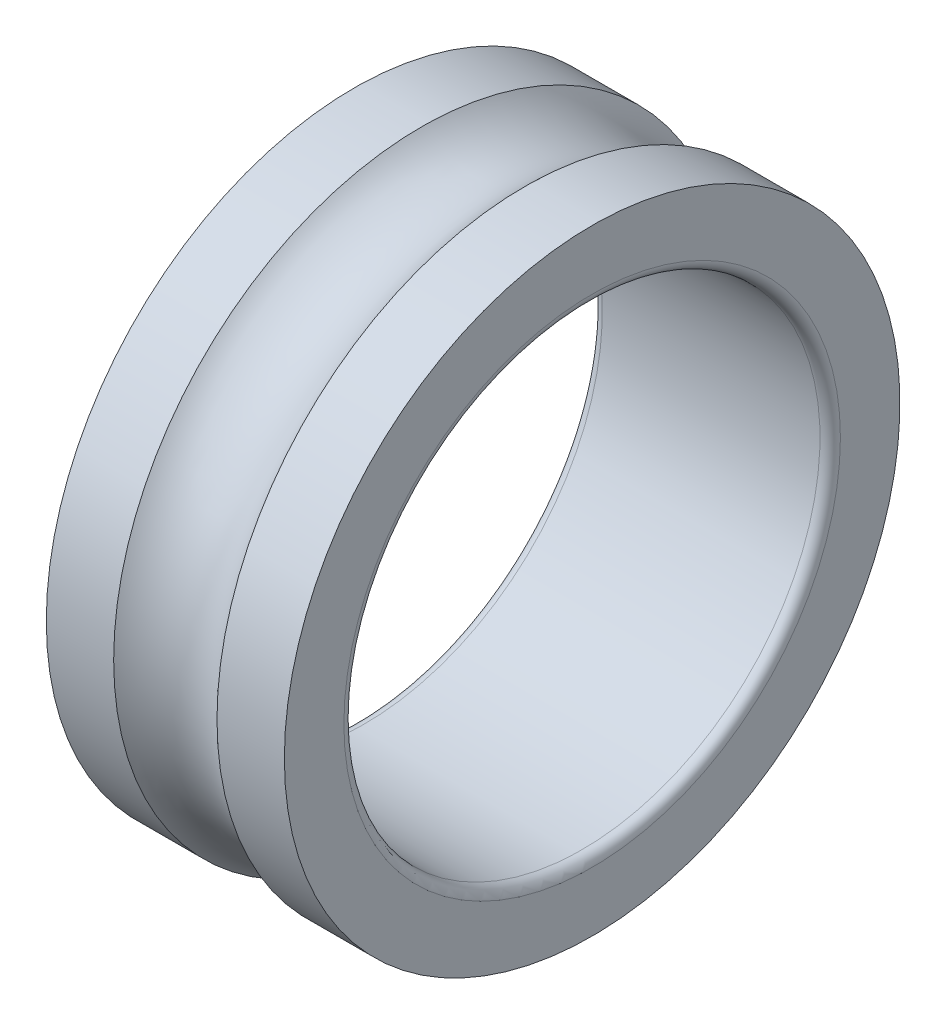
ISO-10303-21;
HEADER;
FILE_DESCRIPTION(('STEP AP214'),'2;1');
FILE_NAME('part.step','',(''),(''),'','','');
FILE_SCHEMA(('AUTOMOTIVE_DESIGN { 1 0 10303 214 1 1 1 1 }'));
ENDSEC;
DATA;
#1=APPLICATION_CONTEXT('core data for automotive mechanical design processes');
#2=APPLICATION_PROTOCOL_DEFINITION('international standard','automotive_design',2000,#1);
#3=PRODUCT_CONTEXT('',#1,'mechanical');
#4=PRODUCT('Part','Part','',(#3));
#5=PRODUCT_RELATED_PRODUCT_CATEGORY('part','',(#4));
#6=PRODUCT_DEFINITION_FORMATION('','',#4);
#7=PRODUCT_DEFINITION_CONTEXT('part definition',#1,'design');
#8=PRODUCT_DEFINITION('design','',#6,#7);
#9=PRODUCT_DEFINITION_SHAPE('','',#8);
#10=(LENGTH_UNIT() NAMED_UNIT(*) SI_UNIT(.MILLI.,.METRE.));
#11=(NAMED_UNIT(*) PLANE_ANGLE_UNIT() SI_UNIT($,.RADIAN.));
#12=(NAMED_UNIT(*) SI_UNIT($,.STERADIAN.) SOLID_ANGLE_UNIT());
#13=UNCERTAINTY_MEASURE_WITH_UNIT(LENGTH_MEASURE(1.E-05),#10,'distance_accuracy_value','');
#14=(GEOMETRIC_REPRESENTATION_CONTEXT(3) GLOBAL_UNCERTAINTY_ASSIGNED_CONTEXT((#13)) GLOBAL_UNIT_ASSIGNED_CONTEXT((#10,
#11,#12)) REPRESENTATION_CONTEXT('',''));
#15=CARTESIAN_POINT('',(0.,0.,0.));
#16=DIRECTION('',(0.,0.,1.));
#17=DIRECTION('',(1.,0.,0.));
#18=AXIS2_PLACEMENT_3D('',#15,#16,#17);
#19=CARTESIAN_POINT('',(3.5,0.,0.));
#20=DIRECTION('',(-1.,0.,0.));
#21=DIRECTION('',(0.,0.,1.));
#22=AXIS2_PLACEMENT_3D('',#19,#20,#21);
#23=CYLINDRICAL_SURFACE('',#22,4.525);
#24=CARTESIAN_POINT('',(0.,0.,0.));
#25=DIRECTION('',(-1.,0.,0.));
#26=DIRECTION('',(0.,0.,1.));
#27=AXIS2_PLACEMENT_3D('',#24,#25,#26);
#28=CIRCLE('',#27,4.525);
#29=CARTESIAN_POINT('',(0.,0.,4.525));
#30=VERTEX_POINT('',#29);
#31=EDGE_CURVE('E10',#30,#30,#28,.T.);
#32=ORIENTED_EDGE('',*,*,#31,.F.);
#33=EDGE_LOOP('',(#32));
#34=FACE_BOUND('',#33,.T.);
#35=CARTESIAN_POINT('',(0.99047712345183,0.,0.));
#36=DIRECTION('',(-1.,0.,0.));
#37=DIRECTION('',(0.,0.,1.));
#38=AXIS2_PLACEMENT_3D('',#35,#36,#37);
#39=CIRCLE('',#38,4.525);
#40=CARTESIAN_POINT('',(0.99047712345183,0.,4.525));
#41=VERTEX_POINT('',#40);
#42=EDGE_CURVE('E57',#41,#41,#39,.T.);
#43=ORIENTED_EDGE('',*,*,#42,.T.);
#44=EDGE_LOOP('',(#43));
#45=FACE_BOUND('',#44,.T.);
#46=ADVANCED_FACE('F29',(#34,#45),#23,.T.);
#47=CARTESIAN_POINT('',(0.,4.525,0.));
#48=DIRECTION('',(1.,0.,0.));
#49=DIRECTION('',(0.,0.,-1.));
#50=AXIS2_PLACEMENT_3D('',#47,#48,#49);
#51=PLANE('',#50);
#52=CARTESIAN_POINT('',(0.,0.,0.));
#53=DIRECTION('',(-1.,0.,0.));
#54=DIRECTION('',(0.,0.,1.));
#55=AXIS2_PLACEMENT_3D('',#52,#53,#54);
#56=CIRCLE('',#55,3.65);
#57=CARTESIAN_POINT('',(0.,0.,3.65));
#58=VERTEX_POINT('',#57);
#59=EDGE_CURVE('E35',#58,#58,#56,.T.);
#60=ORIENTED_EDGE('',*,*,#59,.F.);
#61=EDGE_LOOP('',(#60));
#62=FACE_BOUND('',#61,.T.);
#63=ORIENTED_EDGE('',*,*,#31,.T.);
#64=EDGE_LOOP('',(#63));
#65=FACE_BOUND('',#64,.T.);
#66=ADVANCED_FACE('F94',(#62,#65),#51,.F.);
#67=CARTESIAN_POINT('',(0.14999999999997,0.,0.));
#68=DIRECTION('',(-1.,0.,0.));
#69=DIRECTION('',(0.,0.,1.));
#70=AXIS2_PLACEMENT_3D('',#67,#68,#69);
#71=TOROIDAL_SURFACE('',#70,3.64999999999997,0.14999999999997);
#72=CARTESIAN_POINT('',(0.15,0.,0.));
#73=DIRECTION('',(-1.,0.,0.));
#74=DIRECTION('',(0.,0.,1.));
#75=AXIS2_PLACEMENT_3D('',#72,#73,#74);
#76=CIRCLE('',#75,3.5);
#77=CARTESIAN_POINT('',(0.15,0.,3.5));
#78=VERTEX_POINT('',#77);
#79=EDGE_CURVE('E39',#78,#78,#76,.T.);
#80=ORIENTED_EDGE('',*,*,#79,.F.);
#81=EDGE_LOOP('',(#80));
#82=FACE_BOUND('',#81,.T.);
#83=ORIENTED_EDGE('',*,*,#59,.T.);
#84=EDGE_LOOP('',(#83));
#85=FACE_BOUND('',#84,.T.);
#86=ADVANCED_FACE('F89',(#82,#85),#71,.T.);
#87=CARTESIAN_POINT('',(3.5,0.,0.));
#88=DIRECTION('',(-1.,0.,0.));
#89=DIRECTION('',(0.,0.,1.));
#90=AXIS2_PLACEMENT_3D('',#87,#88,#89);
#91=CYLINDRICAL_SURFACE('',#90,3.5);
#92=CARTESIAN_POINT('',(3.35,0.,0.));
#93=DIRECTION('',(-1.,0.,0.));
#94=DIRECTION('',(0.,0.,1.));
#95=AXIS2_PLACEMENT_3D('',#92,#93,#94);
#96=CIRCLE('',#95,3.5);
#97=CARTESIAN_POINT('',(3.35,0.,3.5));
#98=VERTEX_POINT('',#97);
#99=EDGE_CURVE('E43',#98,#98,#96,.T.);
#100=ORIENTED_EDGE('',*,*,#99,.F.);
#101=EDGE_LOOP('',(#100));
#102=FACE_BOUND('',#101,.T.);
#103=ORIENTED_EDGE('',*,*,#79,.T.);
#104=EDGE_LOOP('',(#103));
#105=FACE_BOUND('',#104,.T.);
#106=ADVANCED_FACE('F83',(#102,#105),#91,.F.);
#107=CARTESIAN_POINT('',(3.35000000000006,0.,0.));
#108=DIRECTION('',(-1.,0.,0.));
#109=DIRECTION('',(0.,0.,1.));
#110=AXIS2_PLACEMENT_3D('',#107,#108,#109);
#111=TOROIDAL_SURFACE('',#110,3.64999999999994,0.149999999999939);
#112=CARTESIAN_POINT('',(3.5,0.,0.));
#113=DIRECTION('',(-1.,0.,0.));
#114=DIRECTION('',(0.,0.,1.));
#115=AXIS2_PLACEMENT_3D('',#112,#113,#114);
#116=CIRCLE('',#115,3.65);
#117=CARTESIAN_POINT('',(3.5,0.,3.65));
#118=VERTEX_POINT('',#117);
#119=EDGE_CURVE('E48',#118,#118,#116,.T.);
#120=ORIENTED_EDGE('',*,*,#119,.F.);
#121=EDGE_LOOP('',(#120));
#122=FACE_BOUND('',#121,.T.);
#123=ORIENTED_EDGE('',*,*,#99,.T.);
#124=EDGE_LOOP('',(#123));
#125=FACE_BOUND('',#124,.T.);
#126=ADVANCED_FACE('F77',(#122,#125),#111,.T.);
#127=CARTESIAN_POINT('',(3.5,3.65,0.));
#128=DIRECTION('',(-1.,0.,0.));
#129=DIRECTION('',(0.,0.,1.));
#130=AXIS2_PLACEMENT_3D('',#127,#128,#129);
#131=PLANE('',#130);
#132=CARTESIAN_POINT('',(3.5,0.,0.));
#133=DIRECTION('',(-1.,0.,0.));
#134=DIRECTION('',(0.,0.,1.));
#135=AXIS2_PLACEMENT_3D('',#132,#133,#134);
#136=CIRCLE('',#135,4.525);
#137=CARTESIAN_POINT('',(3.5,0.,4.525));
#138=VERTEX_POINT('',#137);
#139=EDGE_CURVE('E51',#138,#138,#136,.T.);
#140=ORIENTED_EDGE('',*,*,#139,.F.);
#141=EDGE_LOOP('',(#140));
#142=FACE_BOUND('',#141,.T.);
#143=ORIENTED_EDGE('',*,*,#119,.T.);
#144=EDGE_LOOP('',(#143));
#145=FACE_BOUND('',#144,.T.);
#146=ADVANCED_FACE('F71',(#142,#145),#131,.F.);
#147=CARTESIAN_POINT('',(3.5,0.,0.));
#148=DIRECTION('',(-1.,0.,0.));
#149=DIRECTION('',(0.,0.,1.));
#150=AXIS2_PLACEMENT_3D('',#147,#148,#149);
#151=CYLINDRICAL_SURFACE('',#150,4.525);
#152=CARTESIAN_POINT('',(2.5095228765482,0.,0.));
#153=DIRECTION('',(-1.,0.,0.));
#154=DIRECTION('',(0.,0.,1.));
#155=AXIS2_PLACEMENT_3D('',#152,#153,#154);
#156=CIRCLE('',#155,4.525);
#157=CARTESIAN_POINT('',(2.5095228765482,0.,4.525));
#158=VERTEX_POINT('',#157);
#159=EDGE_CURVE('E54',#158,#158,#156,.T.);
#160=ORIENTED_EDGE('',*,*,#159,.F.);
#161=EDGE_LOOP('',(#160));
#162=FACE_BOUND('',#161,.T.);
#163=ORIENTED_EDGE('',*,*,#139,.T.);
#164=EDGE_LOOP('',(#163));
#165=FACE_BOUND('',#164,.T.);
#166=ADVANCED_FACE('F65',(#162,#165),#151,.T.);
#167=CARTESIAN_POINT('',(1.75000000000002,0.,0.));
#168=DIRECTION('',(-1.,0.,0.));
#169=DIRECTION('',(0.,0.,1.));
#170=AXIS2_PLACEMENT_3D('',#167,#168,#169);
#171=TOROIDAL_SURFACE('',#170,5.25000000000005,1.05000000000005);
#172=ORIENTED_EDGE('',*,*,#42,.F.);
#173=EDGE_LOOP('',(#172));
#174=FACE_BOUND('',#173,.T.);
#175=ORIENTED_EDGE('',*,*,#159,.T.);
#176=EDGE_LOOP('',(#175));
#177=FACE_BOUND('',#176,.T.);
#178=ADVANCED_FACE('F62',(#174,#177),#171,.F.);
#179=CLOSED_SHELL('',(#46,#66,#86,#106,#126,#146,#166,#178));
#180=MANIFOLD_SOLID_BREP('B2',#179);
#181=ADVANCED_BREP_SHAPE_REPRESENTATION('',(#18,#180),#14);
#182=SHAPE_DEFINITION_REPRESENTATION(#9,#181);
ENDSEC;
END-ISO-10303-21;
